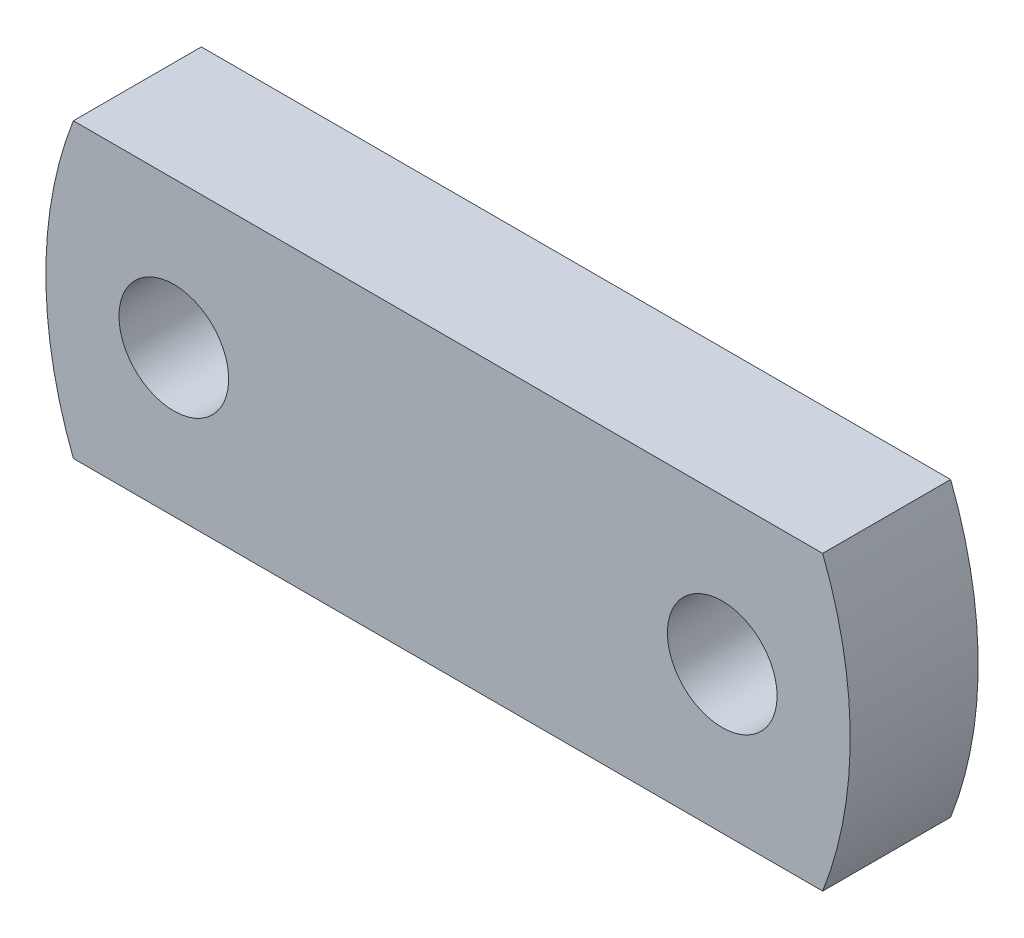
ISO-10303-21;
HEADER;
FILE_DESCRIPTION(('STEP AP214'),'2;1');
FILE_NAME('part.step','',(''),(''),'','','');
FILE_SCHEMA(('AUTOMOTIVE_DESIGN { 1 0 10303 214 1 1 1 1 }'));
ENDSEC;
DATA;
#1=APPLICATION_CONTEXT('core data for automotive mechanical design processes');
#2=APPLICATION_PROTOCOL_DEFINITION('international standard','automotive_design',2000,#1);
#3=PRODUCT_CONTEXT('',#1,'mechanical');
#4=PRODUCT('Part','Part','',(#3));
#5=PRODUCT_RELATED_PRODUCT_CATEGORY('part','',(#4));
#6=PRODUCT_DEFINITION_FORMATION('','',#4);
#7=PRODUCT_DEFINITION_CONTEXT('part definition',#1,'design');
#8=PRODUCT_DEFINITION('design','',#6,#7);
#9=PRODUCT_DEFINITION_SHAPE('','',#8);
#10=(LENGTH_UNIT() NAMED_UNIT(*) SI_UNIT(.MILLI.,.METRE.));
#11=(NAMED_UNIT(*) PLANE_ANGLE_UNIT() SI_UNIT($,.RADIAN.));
#12=(NAMED_UNIT(*) SI_UNIT($,.STERADIAN.) SOLID_ANGLE_UNIT());
#13=UNCERTAINTY_MEASURE_WITH_UNIT(LENGTH_MEASURE(1.E-05),#10,'distance_accuracy_value','');
#14=(GEOMETRIC_REPRESENTATION_CONTEXT(3) GLOBAL_UNCERTAINTY_ASSIGNED_CONTEXT((#13)) GLOBAL_UNIT_ASSIGNED_CONTEXT((#10,
#11,#12)) REPRESENTATION_CONTEXT('',''));
#15=CARTESIAN_POINT('',(0.,0.,0.));
#16=DIRECTION('',(0.,0.,1.));
#17=DIRECTION('',(1.,0.,0.));
#18=AXIS2_PLACEMENT_3D('',#15,#16,#17);
#19=CARTESIAN_POINT('',(0.,0.,35.));
#20=DIRECTION('',(0.,0.,1.));
#21=DIRECTION('',(1.,0.,0.));
#22=AXIS2_PLACEMENT_3D('',#19,#20,#21);
#23=PLANE('',#22);
#24=CARTESIAN_POINT('',(75.,0.,35.));
#25=DIRECTION('',(0.,0.,1.));
#26=DIRECTION('',(1.,0.,0.));
#27=AXIS2_PLACEMENT_3D('',#24,#25,#26);
#28=CIRCLE('',#27,15.);
#29=CARTESIAN_POINT('',(90.,0.,35.));
#30=VERTEX_POINT('',#29);
#31=EDGE_CURVE('E112',#30,#30,#28,.T.);
#32=ORIENTED_EDGE('',*,*,#31,.F.);
#33=EDGE_LOOP('',(#32));
#34=FACE_BOUND('',#33,.T.);
#35=CARTESIAN_POINT('',(0.,0.,35.));
#36=DIRECTION('',(0.,0.,1.));
#37=DIRECTION('',(1.,0.,0.));
#38=AXIS2_PLACEMENT_3D('',#35,#36,#37);
#39=CIRCLE('',#38,110.);
#40=CARTESIAN_POINT('',(-102.469507659596,40.,35.));
#41=VERTEX_POINT('',#40);
#42=CARTESIAN_POINT('',(-102.469507659596,-40.,35.));
#43=VERTEX_POINT('',#42);
#44=EDGE_CURVE('E92',#41,#43,#39,.T.);
#45=ORIENTED_EDGE('',*,*,#44,.T.);
#46=DIRECTION('',(1.,0.,0.));
#47=VECTOR('',#46,1.);
#48=CARTESIAN_POINT('',(-102.469507659596,-40.,35.));
#49=LINE('',#48,#47);
#50=CARTESIAN_POINT('',(102.469507659596,-40.,35.));
#51=VERTEX_POINT('',#50);
#52=EDGE_CURVE('E87',#43,#51,#49,.T.);
#53=ORIENTED_EDGE('',*,*,#52,.T.);
#54=CARTESIAN_POINT('',(0.,0.,35.));
#55=DIRECTION('',(0.,0.,1.));
#56=DIRECTION('',(1.,0.,0.));
#57=AXIS2_PLACEMENT_3D('',#54,#55,#56);
#58=CIRCLE('',#57,110.);
#59=CARTESIAN_POINT('',(102.469507659596,40.,35.));
#60=VERTEX_POINT('',#59);
#61=EDGE_CURVE('E90',#51,#60,#58,.T.);
#62=ORIENTED_EDGE('',*,*,#61,.T.);
#63=DIRECTION('',(-1.,0.,0.));
#64=VECTOR('',#63,1.);
#65=CARTESIAN_POINT('',(-102.469507659596,40.,35.));
#66=LINE('',#65,#64);
#67=EDGE_CURVE('E57',#60,#41,#66,.T.);
#68=ORIENTED_EDGE('',*,*,#67,.T.);
#69=EDGE_LOOP('',(#45,#53,#62,#68));
#70=FACE_BOUND('',#69,.T.);
#71=CARTESIAN_POINT('',(-75.,0.,35.));
#72=DIRECTION('',(0.,0.,1.));
#73=DIRECTION('',(-1.,0.,0.));
#74=AXIS2_PLACEMENT_3D('',#71,#72,#73);
#75=CIRCLE('',#74,15.);
#76=CARTESIAN_POINT('',(-90.,0.,35.));
#77=VERTEX_POINT('',#76);
#78=EDGE_CURVE('E134',#77,#77,#75,.T.);
#79=ORIENTED_EDGE('',*,*,#78,.F.);
#80=EDGE_LOOP('',(#79));
#81=FACE_BOUND('',#80,.T.);
#82=ADVANCED_FACE('F39',(#34,#70,#81),#23,.T.);
#83=CARTESIAN_POINT('',(0.,0.,0.));
#84=DIRECTION('',(0.,0.,1.));
#85=DIRECTION('',(1.,0.,0.));
#86=AXIS2_PLACEMENT_3D('',#83,#84,#85);
#87=PLANE('',#86);
#88=CARTESIAN_POINT('',(0.,0.,0.));
#89=DIRECTION('',(0.,0.,1.));
#90=DIRECTION('',(1.,0.,0.));
#91=AXIS2_PLACEMENT_3D('',#88,#89,#90);
#92=CIRCLE('',#91,110.);
#93=CARTESIAN_POINT('',(-102.469507659596,40.,0.));
#94=VERTEX_POINT('',#93);
#95=CARTESIAN_POINT('',(-102.469507659596,-40.,0.));
#96=VERTEX_POINT('',#95);
#97=EDGE_CURVE('E108',#94,#96,#92,.T.);
#98=ORIENTED_EDGE('',*,*,#97,.F.);
#99=DIRECTION('',(-1.,0.,0.));
#100=VECTOR('',#99,1.);
#101=CARTESIAN_POINT('',(-102.469507659596,40.,0.));
#102=LINE('',#101,#100);
#103=CARTESIAN_POINT('',(102.469507659596,40.,0.));
#104=VERTEX_POINT('',#103);
#105=EDGE_CURVE('E80',#104,#94,#102,.T.);
#106=ORIENTED_EDGE('',*,*,#105,.F.);
#107=CARTESIAN_POINT('',(0.,0.,0.));
#108=DIRECTION('',(0.,0.,1.));
#109=DIRECTION('',(1.,0.,0.));
#110=AXIS2_PLACEMENT_3D('',#107,#108,#109);
#111=CIRCLE('',#110,110.);
#112=CARTESIAN_POINT('',(102.469507659596,-40.,0.));
#113=VERTEX_POINT('',#112);
#114=EDGE_CURVE('E74',#113,#104,#111,.T.);
#115=ORIENTED_EDGE('',*,*,#114,.F.);
#116=DIRECTION('',(1.,0.,0.));
#117=VECTOR('',#116,1.);
#118=CARTESIAN_POINT('',(-102.469507659596,-40.,0.));
#119=LINE('',#118,#117);
#120=EDGE_CURVE('E97',#96,#113,#119,.T.);
#121=ORIENTED_EDGE('',*,*,#120,.F.);
#122=EDGE_LOOP('',(#98,#106,#115,#121));
#123=FACE_BOUND('',#122,.T.);
#124=CARTESIAN_POINT('',(75.,0.,0.));
#125=DIRECTION('',(0.,0.,1.));
#126=DIRECTION('',(1.,0.,0.));
#127=AXIS2_PLACEMENT_3D('',#124,#125,#126);
#128=CIRCLE('',#127,15.);
#129=CARTESIAN_POINT('',(90.,0.,0.));
#130=VERTEX_POINT('',#129);
#131=EDGE_CURVE('E130',#130,#130,#128,.T.);
#132=ORIENTED_EDGE('',*,*,#131,.T.);
#133=EDGE_LOOP('',(#132));
#134=FACE_BOUND('',#133,.T.);
#135=CARTESIAN_POINT('',(-75.,0.,0.));
#136=DIRECTION('',(0.,0.,1.));
#137=DIRECTION('',(-1.,0.,0.));
#138=AXIS2_PLACEMENT_3D('',#135,#136,#137);
#139=CIRCLE('',#138,15.);
#140=CARTESIAN_POINT('',(-90.,0.,0.));
#141=VERTEX_POINT('',#140);
#142=EDGE_CURVE('E138',#141,#141,#139,.T.);
#143=ORIENTED_EDGE('',*,*,#142,.T.);
#144=EDGE_LOOP('',(#143));
#145=FACE_BOUND('',#144,.T.);
#146=ADVANCED_FACE('F125',(#123,#134,#145),#87,.F.);
#147=CARTESIAN_POINT('',(0.,0.,35.));
#148=DIRECTION('',(0.,0.,-1.));
#149=DIRECTION('',(-1.,0.,0.));
#150=AXIS2_PLACEMENT_3D('',#147,#148,#149);
#151=CYLINDRICAL_SURFACE('',#150,110.);
#152=ORIENTED_EDGE('',*,*,#97,.T.);
#153=DIRECTION('',(0.,0.,-1.));
#154=VECTOR('',#153,1.);
#155=CARTESIAN_POINT('',(-102.469507659596,-40.,35.));
#156=LINE('',#155,#154);
#157=EDGE_CURVE('E11',#43,#96,#156,.T.);
#158=ORIENTED_EDGE('',*,*,#157,.F.);
#159=ORIENTED_EDGE('',*,*,#44,.F.);
#160=DIRECTION('',(0.,0.,-1.));
#161=VECTOR('',#160,1.);
#162=CARTESIAN_POINT('',(-102.469507659596,40.,35.));
#163=LINE('',#162,#161);
#164=EDGE_CURVE('E104',#41,#94,#163,.T.);
#165=ORIENTED_EDGE('',*,*,#164,.T.);
#166=EDGE_LOOP('',(#152,#158,#159,#165));
#167=FACE_BOUND('',#166,.T.);
#168=ADVANCED_FACE('F41',(#167),#151,.T.);
#169=CARTESIAN_POINT('',(-102.469507659596,-40.,35.));
#170=DIRECTION('',(0.,1.,0.));
#171=DIRECTION('',(0.,0.,1.));
#172=AXIS2_PLACEMENT_3D('',#169,#170,#171);
#173=PLANE('',#172);
#174=ORIENTED_EDGE('',*,*,#120,.T.);
#175=DIRECTION('',(0.,0.,-1.));
#176=VECTOR('',#175,1.);
#177=CARTESIAN_POINT('',(102.469507659596,-40.,35.));
#178=LINE('',#177,#176);
#179=EDGE_CURVE('E49',#51,#113,#178,.T.);
#180=ORIENTED_EDGE('',*,*,#179,.F.);
#181=ORIENTED_EDGE('',*,*,#52,.F.);
#182=ORIENTED_EDGE('',*,*,#157,.T.);
#183=EDGE_LOOP('',(#174,#180,#181,#182));
#184=FACE_BOUND('',#183,.T.);
#185=ADVANCED_FACE('F96',(#184),#173,.F.);
#186=CARTESIAN_POINT('',(0.,0.,35.));
#187=DIRECTION('',(0.,0.,-1.));
#188=DIRECTION('',(-1.,0.,0.));
#189=AXIS2_PLACEMENT_3D('',#186,#187,#188);
#190=CYLINDRICAL_SURFACE('',#189,110.);
#191=ORIENTED_EDGE('',*,*,#114,.T.);
#192=DIRECTION('',(0.,0.,-1.));
#193=VECTOR('',#192,1.);
#194=CARTESIAN_POINT('',(102.469507659596,40.,35.));
#195=LINE('',#194,#193);
#196=EDGE_CURVE('E99',#60,#104,#195,.T.);
#197=ORIENTED_EDGE('',*,*,#196,.F.);
#198=ORIENTED_EDGE('',*,*,#61,.F.);
#199=ORIENTED_EDGE('',*,*,#179,.T.);
#200=EDGE_LOOP('',(#191,#197,#198,#199));
#201=FACE_BOUND('',#200,.T.);
#202=ADVANCED_FACE('F100',(#201),#190,.T.);
#203=CARTESIAN_POINT('',(-102.469507659596,40.,35.));
#204=DIRECTION('',(0.,-1.,0.));
#205=DIRECTION('',(0.,0.,-1.));
#206=AXIS2_PLACEMENT_3D('',#203,#204,#205);
#207=PLANE('',#206);
#208=ORIENTED_EDGE('',*,*,#105,.T.);
#209=ORIENTED_EDGE('',*,*,#164,.F.);
#210=ORIENTED_EDGE('',*,*,#67,.F.);
#211=ORIENTED_EDGE('',*,*,#196,.T.);
#212=EDGE_LOOP('',(#208,#209,#210,#211));
#213=FACE_BOUND('',#212,.T.);
#214=ADVANCED_FACE('F122',(#213),#207,.F.);
#215=CARTESIAN_POINT('',(75.,0.,35.));
#216=DIRECTION('',(0.,0.,-1.));
#217=DIRECTION('',(-1.,0.,0.));
#218=AXIS2_PLACEMENT_3D('',#215,#216,#217);
#219=CYLINDRICAL_SURFACE('',#218,15.);
#220=ORIENTED_EDGE('',*,*,#31,.T.);
#221=EDGE_LOOP('',(#220));
#222=FACE_BOUND('',#221,.T.);
#223=ORIENTED_EDGE('',*,*,#131,.F.);
#224=EDGE_LOOP('',(#223));
#225=FACE_BOUND('',#224,.T.);
#226=ADVANCED_FACE('F157',(#222,#225),#219,.F.);
#227=CARTESIAN_POINT('',(-75.,0.,35.));
#228=DIRECTION('',(0.,0.,-1.));
#229=DIRECTION('',(-1.,0.,0.));
#230=AXIS2_PLACEMENT_3D('',#227,#228,#229);
#231=CYLINDRICAL_SURFACE('',#230,15.);
#232=ORIENTED_EDGE('',*,*,#78,.T.);
#233=EDGE_LOOP('',(#232));
#234=FACE_BOUND('',#233,.T.);
#235=ORIENTED_EDGE('',*,*,#142,.F.);
#236=EDGE_LOOP('',(#235));
#237=FACE_BOUND('',#236,.T.);
#238=ADVANCED_FACE('F146',(#234,#237),#231,.F.);
#239=CLOSED_SHELL('',(#82,#146,#168,#185,#202,#214,#226,#238));
#240=MANIFOLD_SOLID_BREP('B2',#239);
#241=ADVANCED_BREP_SHAPE_REPRESENTATION('',(#18,#240),#14);
#242=SHAPE_DEFINITION_REPRESENTATION(#9,#241);
ENDSEC;
END-ISO-10303-21;
